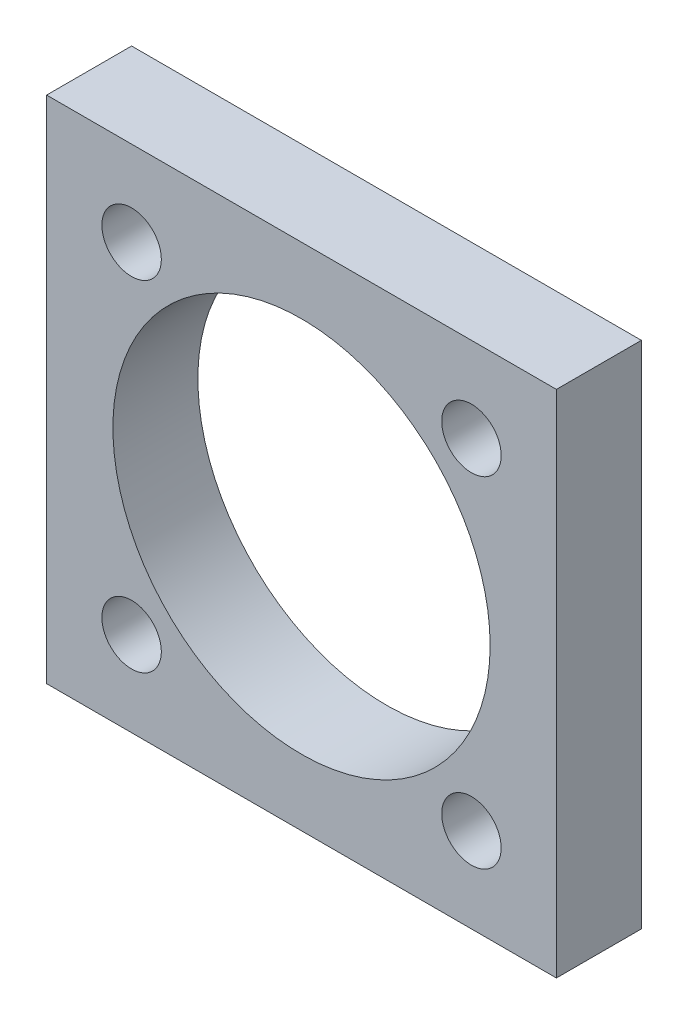
ISO-10303-21;
HEADER;
FILE_DESCRIPTION(('STEP AP214'),'2;1');
FILE_NAME('part.step','',(''),(''),'','','');
FILE_SCHEMA(('AUTOMOTIVE_DESIGN { 1 0 10303 214 1 1 1 1 }'));
ENDSEC;
DATA;
#1=APPLICATION_CONTEXT('core data for automotive mechanical design processes');
#2=APPLICATION_PROTOCOL_DEFINITION('international standard','automotive_design',2000,#1);
#3=PRODUCT_CONTEXT('',#1,'mechanical');
#4=PRODUCT('Part','Part','',(#3));
#5=PRODUCT_RELATED_PRODUCT_CATEGORY('part','',(#4));
#6=PRODUCT_DEFINITION_FORMATION('','',#4);
#7=PRODUCT_DEFINITION_CONTEXT('part definition',#1,'design');
#8=PRODUCT_DEFINITION('design','',#6,#7);
#9=PRODUCT_DEFINITION_SHAPE('','',#8);
#10=(LENGTH_UNIT() NAMED_UNIT(*) SI_UNIT(.MILLI.,.METRE.));
#11=(NAMED_UNIT(*) PLANE_ANGLE_UNIT() SI_UNIT($,.RADIAN.));
#12=(NAMED_UNIT(*) SI_UNIT($,.STERADIAN.) SOLID_ANGLE_UNIT());
#13=UNCERTAINTY_MEASURE_WITH_UNIT(LENGTH_MEASURE(1.E-05),#10,'distance_accuracy_value','');
#14=(GEOMETRIC_REPRESENTATION_CONTEXT(3) GLOBAL_UNCERTAINTY_ASSIGNED_CONTEXT((#13)) GLOBAL_UNIT_ASSIGNED_CONTEXT((#10,
#11,#12)) REPRESENTATION_CONTEXT('',''));
#15=CARTESIAN_POINT('',(0.,0.,0.));
#16=DIRECTION('',(0.,0.,1.));
#17=DIRECTION('',(1.,0.,0.));
#18=AXIS2_PLACEMENT_3D('',#15,#16,#17);
#19=CARTESIAN_POINT('',(0.,0.,5.));
#20=DIRECTION('',(0.,0.,1.));
#21=DIRECTION('',(1.,0.,0.));
#22=AXIS2_PLACEMENT_3D('',#19,#20,#21);
#23=PLANE('',#22);
#24=CARTESIAN_POINT('',(10.,-10.,5.));
#25=DIRECTION('',(0.,0.,1.));
#26=DIRECTION('',(1.,0.,0.));
#27=AXIS2_PLACEMENT_3D('',#24,#25,#26);
#28=CIRCLE('',#27,1.75);
#29=CARTESIAN_POINT('',(11.75,-10.,5.));
#30=VERTEX_POINT('',#29);
#31=EDGE_CURVE('E126',#30,#30,#28,.T.);
#32=ORIENTED_EDGE('',*,*,#31,.F.);
#33=EDGE_LOOP('',(#32));
#34=FACE_BOUND('',#33,.T.);
#35=CARTESIAN_POINT('',(0.,0.,5.));
#36=DIRECTION('',(0.,0.,1.));
#37=DIRECTION('',(1.,0.,0.));
#38=AXIS2_PLACEMENT_3D('',#35,#36,#37);
#39=CIRCLE('',#38,11.1);
#40=CARTESIAN_POINT('',(11.1,0.,5.));
#41=VERTEX_POINT('',#40);
#42=EDGE_CURVE('E114',#41,#41,#39,.T.);
#43=ORIENTED_EDGE('',*,*,#42,.F.);
#44=EDGE_LOOP('',(#43));
#45=FACE_BOUND('',#44,.T.);
#46=DIRECTION('',(0.,1.,0.));
#47=VECTOR('',#46,1.);
#48=CARTESIAN_POINT('',(15.,-15.,5.));
#49=LINE('',#48,#47);
#50=CARTESIAN_POINT('',(15.,-15.,5.));
#51=VERTEX_POINT('',#50);
#52=CARTESIAN_POINT('',(15.,15.,5.));
#53=VERTEX_POINT('',#52);
#54=EDGE_CURVE('E84',#51,#53,#49,.T.);
#55=ORIENTED_EDGE('',*,*,#54,.T.);
#56=DIRECTION('',(-1.,0.,0.));
#57=VECTOR('',#56,1.);
#58=CARTESIAN_POINT('',(15.,15.,5.));
#59=LINE('',#58,#57);
#60=CARTESIAN_POINT('',(-15.,15.,5.));
#61=VERTEX_POINT('',#60);
#62=EDGE_CURVE('E79',#53,#61,#59,.T.);
#63=ORIENTED_EDGE('',*,*,#62,.T.);
#64=DIRECTION('',(0.,-1.,0.));
#65=VECTOR('',#64,1.);
#66=CARTESIAN_POINT('',(-15.,-15.,5.));
#67=LINE('',#66,#65);
#68=CARTESIAN_POINT('',(-15.,-15.,5.));
#69=VERTEX_POINT('',#68);
#70=EDGE_CURVE('E82',#61,#69,#67,.T.);
#71=ORIENTED_EDGE('',*,*,#70,.T.);
#72=DIRECTION('',(1.,0.,0.));
#73=VECTOR('',#72,1.);
#74=CARTESIAN_POINT('',(15.,-15.,5.));
#75=LINE('',#74,#73);
#76=EDGE_CURVE('E49',#69,#51,#75,.T.);
#77=ORIENTED_EDGE('',*,*,#76,.T.);
#78=EDGE_LOOP('',(#55,#63,#71,#77));
#79=FACE_BOUND('',#78,.T.);
#80=CARTESIAN_POINT('',(-10.,10.,5.));
#81=DIRECTION('',(0.,0.,1.));
#82=DIRECTION('',(1.,0.,0.));
#83=AXIS2_PLACEMENT_3D('',#80,#81,#82);
#84=CIRCLE('',#83,1.75);
#85=CARTESIAN_POINT('',(-8.25,10.,5.));
#86=VERTEX_POINT('',#85);
#87=EDGE_CURVE('E99',#86,#86,#84,.T.);
#88=ORIENTED_EDGE('',*,*,#87,.F.);
#89=EDGE_LOOP('',(#88));
#90=FACE_BOUND('',#89,.T.);
#91=CARTESIAN_POINT('',(10.,10.,5.));
#92=DIRECTION('',(0.,0.,1.));
#93=DIRECTION('',(1.,0.,0.));
#94=AXIS2_PLACEMENT_3D('',#91,#92,#93);
#95=CIRCLE('',#94,1.75);
#96=CARTESIAN_POINT('',(11.75,10.,5.));
#97=VERTEX_POINT('',#96);
#98=EDGE_CURVE('E120',#97,#97,#95,.T.);
#99=ORIENTED_EDGE('',*,*,#98,.F.);
#100=EDGE_LOOP('',(#99));
#101=FACE_BOUND('',#100,.T.);
#102=CARTESIAN_POINT('',(-10.,-10.,5.));
#103=DIRECTION('',(0.,0.,1.));
#104=DIRECTION('',(1.,0.,0.));
#105=AXIS2_PLACEMENT_3D('',#102,#103,#104);
#106=CIRCLE('',#105,1.75);
#107=CARTESIAN_POINT('',(-8.25,-10.,5.));
#108=VERTEX_POINT('',#107);
#109=EDGE_CURVE('E132',#108,#108,#106,.T.);
#110=ORIENTED_EDGE('',*,*,#109,.F.);
#111=EDGE_LOOP('',(#110));
#112=FACE_BOUND('',#111,.T.);
#113=ADVANCED_FACE('F32',(#34,#45,#79,#90,#101,#112),#23,.T.);
#114=CARTESIAN_POINT('',(0.,0.,0.));
#115=DIRECTION('',(0.,0.,1.));
#116=DIRECTION('',(1.,0.,0.));
#117=AXIS2_PLACEMENT_3D('',#114,#115,#116);
#118=PLANE('',#117);
#119=CARTESIAN_POINT('',(10.,-10.,0.));
#120=DIRECTION('',(0.,0.,1.));
#121=DIRECTION('',(1.,0.,0.));
#122=AXIS2_PLACEMENT_3D('',#119,#120,#121);
#123=CIRCLE('',#122,1.75);
#124=CARTESIAN_POINT('',(11.75,-10.,0.));
#125=VERTEX_POINT('',#124);
#126=EDGE_CURVE('E129',#125,#125,#123,.T.);
#127=ORIENTED_EDGE('',*,*,#126,.T.);
#128=EDGE_LOOP('',(#127));
#129=FACE_BOUND('',#128,.T.);
#130=CARTESIAN_POINT('',(0.,0.,0.));
#131=DIRECTION('',(0.,0.,1.));
#132=DIRECTION('',(1.,0.,0.));
#133=AXIS2_PLACEMENT_3D('',#130,#131,#132);
#134=CIRCLE('',#133,11.1);
#135=CARTESIAN_POINT('',(11.1,0.,0.));
#136=VERTEX_POINT('',#135);
#137=EDGE_CURVE('E117',#136,#136,#134,.T.);
#138=ORIENTED_EDGE('',*,*,#137,.T.);
#139=EDGE_LOOP('',(#138));
#140=FACE_BOUND('',#139,.T.);
#141=DIRECTION('',(0.,1.,0.));
#142=VECTOR('',#141,1.);
#143=CARTESIAN_POINT('',(15.,-15.,0.));
#144=LINE('',#143,#142);
#145=CARTESIAN_POINT('',(15.,-15.,0.));
#146=VERTEX_POINT('',#145);
#147=CARTESIAN_POINT('',(15.,15.,0.));
#148=VERTEX_POINT('',#147);
#149=EDGE_CURVE('E96',#146,#148,#144,.T.);
#150=ORIENTED_EDGE('',*,*,#149,.F.);
#151=DIRECTION('',(1.,0.,0.));
#152=VECTOR('',#151,1.);
#153=CARTESIAN_POINT('',(15.,-15.,0.));
#154=LINE('',#153,#152);
#155=CARTESIAN_POINT('',(-15.,-15.,0.));
#156=VERTEX_POINT('',#155);
#157=EDGE_CURVE('E72',#156,#146,#154,.T.);
#158=ORIENTED_EDGE('',*,*,#157,.F.);
#159=DIRECTION('',(0.,-1.,0.));
#160=VECTOR('',#159,1.);
#161=CARTESIAN_POINT('',(-15.,-15.,0.));
#162=LINE('',#161,#160);
#163=CARTESIAN_POINT('',(-15.,15.,0.));
#164=VERTEX_POINT('',#163);
#165=EDGE_CURVE('E66',#164,#156,#162,.T.);
#166=ORIENTED_EDGE('',*,*,#165,.F.);
#167=DIRECTION('',(-1.,0.,0.));
#168=VECTOR('',#167,1.);
#169=CARTESIAN_POINT('',(15.,15.,0.));
#170=LINE('',#169,#168);
#171=EDGE_CURVE('E88',#148,#164,#170,.T.);
#172=ORIENTED_EDGE('',*,*,#171,.F.);
#173=EDGE_LOOP('',(#150,#158,#166,#172));
#174=FACE_BOUND('',#173,.T.);
#175=CARTESIAN_POINT('',(-10.,10.,0.));
#176=DIRECTION('',(0.,0.,1.));
#177=DIRECTION('',(1.,0.,0.));
#178=AXIS2_PLACEMENT_3D('',#175,#176,#177);
#179=CIRCLE('',#178,1.75);
#180=CARTESIAN_POINT('',(-8.25,10.,0.));
#181=VERTEX_POINT('',#180);
#182=EDGE_CURVE('E111',#181,#181,#179,.T.);
#183=ORIENTED_EDGE('',*,*,#182,.T.);
#184=EDGE_LOOP('',(#183));
#185=FACE_BOUND('',#184,.T.);
#186=CARTESIAN_POINT('',(10.,10.,0.));
#187=DIRECTION('',(0.,0.,1.));
#188=DIRECTION('',(1.,0.,0.));
#189=AXIS2_PLACEMENT_3D('',#186,#187,#188);
#190=CIRCLE('',#189,1.75);
#191=CARTESIAN_POINT('',(11.75,10.,0.));
#192=VERTEX_POINT('',#191);
#193=EDGE_CURVE('E123',#192,#192,#190,.T.);
#194=ORIENTED_EDGE('',*,*,#193,.T.);
#195=EDGE_LOOP('',(#194));
#196=FACE_BOUND('',#195,.T.);
#197=CARTESIAN_POINT('',(-10.,-10.,0.));
#198=DIRECTION('',(0.,0.,1.));
#199=DIRECTION('',(1.,0.,0.));
#200=AXIS2_PLACEMENT_3D('',#197,#198,#199);
#201=CIRCLE('',#200,1.75);
#202=CARTESIAN_POINT('',(-8.25,-10.,0.));
#203=VERTEX_POINT('',#202);
#204=EDGE_CURVE('E135',#203,#203,#201,.T.);
#205=ORIENTED_EDGE('',*,*,#204,.T.);
#206=EDGE_LOOP('',(#205));
#207=FACE_BOUND('',#206,.T.);
#208=ADVANCED_FACE('F107',(#129,#140,#174,#185,#196,#207),#118,.F.);
#209=CARTESIAN_POINT('',(15.,-15.,5.));
#210=DIRECTION('',(-1.,0.,0.));
#211=DIRECTION('',(0.,-1.,0.));
#212=AXIS2_PLACEMENT_3D('',#209,#210,#211);
#213=PLANE('',#212);
#214=ORIENTED_EDGE('',*,*,#149,.T.);
#215=DIRECTION('',(0.,0.,-1.));
#216=VECTOR('',#215,1.);
#217=CARTESIAN_POINT('',(15.,15.,5.));
#218=LINE('',#217,#216);
#219=EDGE_CURVE('E11',#53,#148,#218,.T.);
#220=ORIENTED_EDGE('',*,*,#219,.F.);
#221=ORIENTED_EDGE('',*,*,#54,.F.);
#222=DIRECTION('',(0.,0.,-1.));
#223=VECTOR('',#222,1.);
#224=CARTESIAN_POINT('',(15.,-15.,5.));
#225=LINE('',#224,#223);
#226=EDGE_CURVE('E92',#51,#146,#225,.T.);
#227=ORIENTED_EDGE('',*,*,#226,.T.);
#228=EDGE_LOOP('',(#214,#220,#221,#227));
#229=FACE_BOUND('',#228,.T.);
#230=ADVANCED_FACE('F34',(#229),#213,.F.);
#231=CARTESIAN_POINT('',(15.,15.,5.));
#232=DIRECTION('',(0.,-1.,0.));
#233=DIRECTION('',(0.,0.,-1.));
#234=AXIS2_PLACEMENT_3D('',#231,#232,#233);
#235=PLANE('',#234);
#236=ORIENTED_EDGE('',*,*,#171,.T.);
#237=DIRECTION('',(0.,0.,-1.));
#238=VECTOR('',#237,1.);
#239=CARTESIAN_POINT('',(-15.,15.,5.));
#240=LINE('',#239,#238);
#241=EDGE_CURVE('E41',#61,#164,#240,.T.);
#242=ORIENTED_EDGE('',*,*,#241,.F.);
#243=ORIENTED_EDGE('',*,*,#62,.F.);
#244=ORIENTED_EDGE('',*,*,#219,.T.);
#245=EDGE_LOOP('',(#236,#242,#243,#244));
#246=FACE_BOUND('',#245,.T.);
#247=ADVANCED_FACE('F87',(#246),#235,.F.);
#248=CARTESIAN_POINT('',(-15.,-15.,5.));
#249=DIRECTION('',(1.,0.,0.));
#250=DIRECTION('',(0.,1.,0.));
#251=AXIS2_PLACEMENT_3D('',#248,#249,#250);
#252=PLANE('',#251);
#253=ORIENTED_EDGE('',*,*,#165,.T.);
#254=DIRECTION('',(0.,0.,-1.));
#255=VECTOR('',#254,1.);
#256=CARTESIAN_POINT('',(-15.,-15.,5.));
#257=LINE('',#256,#255);
#258=EDGE_CURVE('E89',#69,#156,#257,.T.);
#259=ORIENTED_EDGE('',*,*,#258,.F.);
#260=ORIENTED_EDGE('',*,*,#70,.F.);
#261=ORIENTED_EDGE('',*,*,#241,.T.);
#262=EDGE_LOOP('',(#253,#259,#260,#261));
#263=FACE_BOUND('',#262,.T.);
#264=ADVANCED_FACE('F90',(#263),#252,.F.);
#265=CARTESIAN_POINT('',(15.,-15.,5.));
#266=DIRECTION('',(0.,1.,0.));
#267=DIRECTION('',(-1.,0.,0.));
#268=AXIS2_PLACEMENT_3D('',#265,#266,#267);
#269=PLANE('',#268);
#270=ORIENTED_EDGE('',*,*,#157,.T.);
#271=ORIENTED_EDGE('',*,*,#226,.F.);
#272=ORIENTED_EDGE('',*,*,#76,.F.);
#273=ORIENTED_EDGE('',*,*,#258,.T.);
#274=EDGE_LOOP('',(#270,#271,#272,#273));
#275=FACE_BOUND('',#274,.T.);
#276=ADVANCED_FACE('F104',(#275),#269,.F.);
#277=CARTESIAN_POINT('',(-10.,10.,5.));
#278=DIRECTION('',(0.,0.,-1.));
#279=DIRECTION('',(-1.,0.,0.));
#280=AXIS2_PLACEMENT_3D('',#277,#278,#279);
#281=CYLINDRICAL_SURFACE('',#280,1.75);
#282=ORIENTED_EDGE('',*,*,#87,.T.);
#283=EDGE_LOOP('',(#282));
#284=FACE_BOUND('',#283,.T.);
#285=ORIENTED_EDGE('',*,*,#182,.F.);
#286=EDGE_LOOP('',(#285));
#287=FACE_BOUND('',#286,.T.);
#288=ADVANCED_FACE('F155',(#284,#287),#281,.F.);
#289=CARTESIAN_POINT('',(0.,0.,5.));
#290=DIRECTION('',(0.,0.,-1.));
#291=DIRECTION('',(-1.,0.,0.));
#292=AXIS2_PLACEMENT_3D('',#289,#290,#291);
#293=CYLINDRICAL_SURFACE('',#292,11.1);
#294=ORIENTED_EDGE('',*,*,#42,.T.);
#295=EDGE_LOOP('',(#294));
#296=FACE_BOUND('',#295,.T.);
#297=ORIENTED_EDGE('',*,*,#137,.F.);
#298=EDGE_LOOP('',(#297));
#299=FACE_BOUND('',#298,.T.);
#300=ADVANCED_FACE('F201',(#296,#299),#293,.F.);
#301=CARTESIAN_POINT('',(10.,10.,5.));
#302=DIRECTION('',(0.,0.,-1.));
#303=DIRECTION('',(-1.,0.,0.));
#304=AXIS2_PLACEMENT_3D('',#301,#302,#303);
#305=CYLINDRICAL_SURFACE('',#304,1.75);
#306=ORIENTED_EDGE('',*,*,#98,.T.);
#307=EDGE_LOOP('',(#306));
#308=FACE_BOUND('',#307,.T.);
#309=ORIENTED_EDGE('',*,*,#193,.F.);
#310=EDGE_LOOP('',(#309));
#311=FACE_BOUND('',#310,.T.);
#312=ADVANCED_FACE('F209',(#308,#311),#305,.F.);
#313=CARTESIAN_POINT('',(10.,-10.,5.));
#314=DIRECTION('',(0.,0.,-1.));
#315=DIRECTION('',(-1.,0.,0.));
#316=AXIS2_PLACEMENT_3D('',#313,#314,#315);
#317=CYLINDRICAL_SURFACE('',#316,1.75);
#318=ORIENTED_EDGE('',*,*,#31,.T.);
#319=EDGE_LOOP('',(#318));
#320=FACE_BOUND('',#319,.T.);
#321=ORIENTED_EDGE('',*,*,#126,.F.);
#322=EDGE_LOOP('',(#321));
#323=FACE_BOUND('',#322,.T.);
#324=ADVANCED_FACE('F217',(#320,#323),#317,.F.);
#325=CARTESIAN_POINT('',(-10.,-10.,5.));
#326=DIRECTION('',(0.,0.,-1.));
#327=DIRECTION('',(-1.,0.,0.));
#328=AXIS2_PLACEMENT_3D('',#325,#326,#327);
#329=CYLINDRICAL_SURFACE('',#328,1.75);
#330=ORIENTED_EDGE('',*,*,#109,.T.);
#331=EDGE_LOOP('',(#330));
#332=FACE_BOUND('',#331,.T.);
#333=ORIENTED_EDGE('',*,*,#204,.F.);
#334=EDGE_LOOP('',(#333));
#335=FACE_BOUND('',#334,.T.);
#336=ADVANCED_FACE('F141',(#332,#335),#329,.F.);
#337=CLOSED_SHELL('',(#113,#208,#230,#247,#264,#276,#288,#300,#312,#324,#336));
#338=MANIFOLD_SOLID_BREP('B2',#337);
#339=ADVANCED_BREP_SHAPE_REPRESENTATION('',(#18,#338),#14);
#340=SHAPE_DEFINITION_REPRESENTATION(#9,#339);
ENDSEC;
END-ISO-10303-21;
